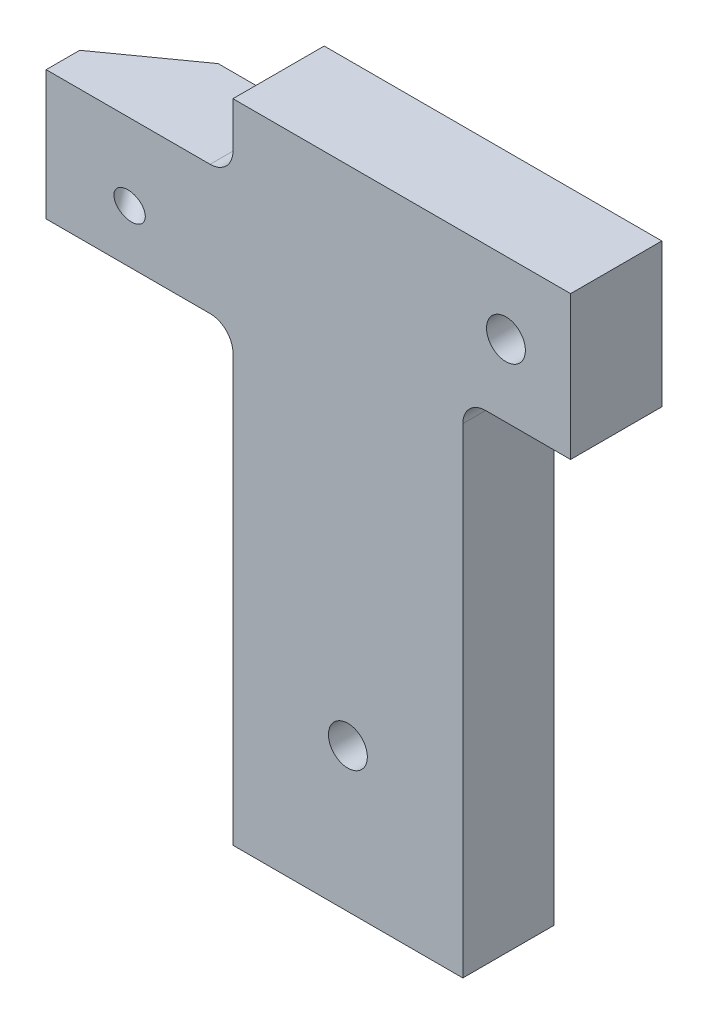
ISO-10303-21;
HEADER;
FILE_DESCRIPTION(('STEP AP214'),'2;1');
FILE_NAME('part.step','',(''),(''),'','','');
FILE_SCHEMA(('AUTOMOTIVE_DESIGN { 1 0 10303 214 1 1 1 1 }'));
ENDSEC;
DATA;
#1=APPLICATION_CONTEXT('core data for automotive mechanical design processes');
#2=APPLICATION_PROTOCOL_DEFINITION('international standard','automotive_design',2000,#1);
#3=PRODUCT_CONTEXT('',#1,'mechanical');
#4=PRODUCT('Part','Part','',(#3));
#5=PRODUCT_RELATED_PRODUCT_CATEGORY('part','',(#4));
#6=PRODUCT_DEFINITION_FORMATION('','',#4);
#7=PRODUCT_DEFINITION_CONTEXT('part definition',#1,'design');
#8=PRODUCT_DEFINITION('design','',#6,#7);
#9=PRODUCT_DEFINITION_SHAPE('','',#8);
#10=(LENGTH_UNIT() NAMED_UNIT(*) SI_UNIT(.MILLI.,.METRE.));
#11=(NAMED_UNIT(*) PLANE_ANGLE_UNIT() SI_UNIT($,.RADIAN.));
#12=(NAMED_UNIT(*) SI_UNIT($,.STERADIAN.) SOLID_ANGLE_UNIT());
#13=UNCERTAINTY_MEASURE_WITH_UNIT(LENGTH_MEASURE(1.E-05),#10,'distance_accuracy_value','');
#14=(GEOMETRIC_REPRESENTATION_CONTEXT(3) GLOBAL_UNCERTAINTY_ASSIGNED_CONTEXT((#13)) GLOBAL_UNIT_ASSIGNED_CONTEXT((#10,
#11,#12)) REPRESENTATION_CONTEXT('',''));
#15=CARTESIAN_POINT('',(0.,0.,0.));
#16=DIRECTION('',(0.,0.,1.));
#17=DIRECTION('',(1.,0.,0.));
#18=AXIS2_PLACEMENT_3D('',#15,#16,#17);
#19=CARTESIAN_POINT('',(0.,0.,6.35));
#20=DIRECTION('',(1.,0.,0.));
#21=DIRECTION('',(0.,0.,-1.));
#22=AXIS2_PLACEMENT_3D('',#19,#20,#21);
#23=PLANE('',#22);
#24=DIRECTION('',(0.,-1.,0.));
#25=VECTOR('',#24,1.);
#26=CARTESIAN_POINT('',(0.,0.,6.35));
#27=LINE('',#26,#25);
#28=CARTESIAN_POINT('',(0.,40.25,6.35));
#29=VERTEX_POINT('',#28);
#30=CARTESIAN_POINT('',(0.,31.25,6.35));
#31=VERTEX_POINT('',#30);
#32=EDGE_CURVE('E178',#29,#31,#27,.T.);
#33=ORIENTED_EDGE('',*,*,#32,.F.);
#34=DIRECTION('',(0.,0.,-1.));
#35=VECTOR('',#34,1.);
#36=CARTESIAN_POINT('',(0.,40.25,19.));
#37=LINE('',#36,#35);
#38=CARTESIAN_POINT('',(0.,40.25,4.01534281482165));
#39=VERTEX_POINT('',#38);
#40=EDGE_CURVE('E159',#29,#39,#37,.T.);
#41=ORIENTED_EDGE('',*,*,#40,.T.);
#42=DIRECTION('',(0.,0.979906593686997,0.199456931814229));
#43=VECTOR('',#42,1.);
#44=CARTESIAN_POINT('',(0.,2.05757526475973,-3.75860615675775));
#45=LINE('',#44,#43);
#46=CARTESIAN_POINT('',(0.,31.25,2.18342087665632));
#47=VERTEX_POINT('',#46);
#48=EDGE_CURVE('E165',#47,#39,#45,.T.);
#49=ORIENTED_EDGE('',*,*,#48,.F.);
#50=DIRECTION('',(0.,0.,-1.));
#51=VECTOR('',#50,1.);
#52=CARTESIAN_POINT('',(0.,31.25,19.));
#53=LINE('',#52,#51);
#54=EDGE_CURVE('E234',#31,#47,#53,.T.);
#55=ORIENTED_EDGE('',*,*,#54,.F.);
#56=EDGE_LOOP('',(#33,#41,#49,#55));
#57=FACE_BOUND('',#56,.T.);
#58=ADVANCED_FACE('F40',(#57),#23,.F.);
#59=CARTESIAN_POINT('',(0.,45.,6.35));
#60=DIRECTION('',(0.,-1.,0.));
#61=DIRECTION('',(0.,0.,-1.));
#62=AXIS2_PLACEMENT_3D('',#59,#60,#61);
#63=PLANE('',#62);
#64=DIRECTION('',(-1.,0.,0.));
#65=VECTOR('',#64,1.);
#66=CARTESIAN_POINT('',(0.,45.,0.));
#67=LINE('',#66,#65);
#68=CARTESIAN_POINT('',(36.5,45.,0.));
#69=VERTEX_POINT('',#68);
#70=CARTESIAN_POINT('',(12.9999999999999,45.,0.));
#71=VERTEX_POINT('',#70);
#72=EDGE_CURVE('E167',#69,#71,#67,.T.);
#73=ORIENTED_EDGE('',*,*,#72,.T.);
#74=DIRECTION('',(0.,0.,-1.));
#75=VECTOR('',#74,1.);
#76=CARTESIAN_POINT('',(12.9999999999999,45.,19.));
#77=LINE('',#76,#75);
#78=CARTESIAN_POINT('',(12.9999999999999,45.,6.35));
#79=VERTEX_POINT('',#78);
#80=EDGE_CURVE('E212',#79,#71,#77,.T.);
#81=ORIENTED_EDGE('',*,*,#80,.F.);
#82=DIRECTION('',(-1.,0.,0.));
#83=VECTOR('',#82,1.);
#84=CARTESIAN_POINT('',(0.,45.,6.35));
#85=LINE('',#84,#83);
#86=CARTESIAN_POINT('',(36.5,45.,6.35));
#87=VERTEX_POINT('',#86);
#88=EDGE_CURVE('E173',#87,#79,#85,.T.);
#89=ORIENTED_EDGE('',*,*,#88,.F.);
#90=DIRECTION('',(0.,0.,-1.));
#91=VECTOR('',#90,1.);
#92=CARTESIAN_POINT('',(36.5,45.,6.35));
#93=LINE('',#92,#91);
#94=EDGE_CURVE('E179',#87,#69,#93,.T.);
#95=ORIENTED_EDGE('',*,*,#94,.T.);
#96=EDGE_LOOP('',(#73,#81,#89,#95));
#97=FACE_BOUND('',#96,.T.);
#98=ADVANCED_FACE('F216',(#97),#63,.F.);
#99=CARTESIAN_POINT('',(0.,0.,0.));
#100=DIRECTION('',(0.,0.,-1.));
#101=DIRECTION('',(-1.,0.,0.));
#102=AXIS2_PLACEMENT_3D('',#99,#100,#101);
#103=PLANE('',#102);
#104=CARTESIAN_POINT('',(20.9999999999998,10.0000000000001,0.));
#105=DIRECTION('',(0.,0.,-1.));
#106=DIRECTION('',(-1.,0.,0.));
#107=AXIS2_PLACEMENT_3D('',#104,#105,#106);
#108=CIRCLE('',#107,2.38125);
#109=CARTESIAN_POINT('',(18.6187499999998,10.0000000000001,0.));
#110=VERTEX_POINT('',#109);
#111=EDGE_CURVE('E322',#110,#110,#108,.T.);
#112=ORIENTED_EDGE('',*,*,#111,.F.);
#113=EDGE_LOOP('',(#112));
#114=FACE_BOUND('',#113,.T.);
#115=CARTESIAN_POINT('',(31.9999999999997,40.0000000000001,0.));
#116=DIRECTION('',(0.,0.,-1.));
#117=DIRECTION('',(-1.,0.,0.));
#118=AXIS2_PLACEMENT_3D('',#115,#116,#117);
#119=CIRCLE('',#118,2.38125);
#120=CARTESIAN_POINT('',(29.6187499999997,40.0000000000001,0.));
#121=VERTEX_POINT('',#120);
#122=EDGE_CURVE('E310',#121,#121,#119,.T.);
#123=ORIENTED_EDGE('',*,*,#122,.F.);
#124=EDGE_LOOP('',(#123));
#125=FACE_BOUND('',#124,.T.);
#126=DIRECTION('',(-1.,0.,0.));
#127=VECTOR('',#126,1.);
#128=CARTESIAN_POINT('',(11.4124999999999,40.25,0.));
#129=LINE('',#128,#127);
#130=CARTESIAN_POINT('',(11.4124999999999,40.25,0.));
#131=VERTEX_POINT('',#130);
#132=CARTESIAN_POINT('',(5.62283855684455,40.25,0.));
#133=VERTEX_POINT('',#132);
#134=EDGE_CURVE('E62',#131,#133,#129,.T.);
#135=ORIENTED_EDGE('',*,*,#134,.F.);
#136=CARTESIAN_POINT('',(11.4124999999999,41.8375,0.));
#137=DIRECTION('',(0.,0.,-1.));
#138=DIRECTION('',(-1.,0.,0.));
#139=AXIS2_PLACEMENT_3D('',#136,#137,#138);
#140=CIRCLE('',#139,1.5875);
#141=CARTESIAN_POINT('',(12.9999999999999,41.8375,0.));
#142=VERTEX_POINT('',#141);
#143=EDGE_CURVE('E221',#142,#131,#140,.T.);
#144=ORIENTED_EDGE('',*,*,#143,.F.);
#145=DIRECTION('',(0.,-1.,0.));
#146=VECTOR('',#145,1.);
#147=CARTESIAN_POINT('',(12.9999999999999,45.,0.));
#148=LINE('',#147,#146);
#149=EDGE_CURVE('E256',#71,#142,#148,.T.);
#150=ORIENTED_EDGE('',*,*,#149,.F.);
#151=ORIENTED_EDGE('',*,*,#72,.F.);
#152=DIRECTION('',(0.,1.,0.));
#153=VECTOR('',#152,1.);
#154=CARTESIAN_POINT('',(36.5,0.,0.));
#155=LINE('',#154,#153);
#156=CARTESIAN_POINT('',(36.5,35.,0.));
#157=VERTEX_POINT('',#156);
#158=EDGE_CURVE('E164',#157,#69,#155,.T.);
#159=ORIENTED_EDGE('',*,*,#158,.F.);
#160=DIRECTION('',(1.,0.,0.));
#161=VECTOR('',#160,1.);
#162=CARTESIAN_POINT('',(36.5,35.,0.));
#163=LINE('',#162,#161);
#164=CARTESIAN_POINT('',(30.5874999999999,35.,0.));
#165=VERTEX_POINT('',#164);
#166=EDGE_CURVE('E149',#165,#157,#163,.T.);
#167=ORIENTED_EDGE('',*,*,#166,.F.);
#168=CARTESIAN_POINT('',(30.5874999999999,33.4125,0.));
#169=DIRECTION('',(0.,0.,-1.));
#170=DIRECTION('',(1.,0.,0.));
#171=AXIS2_PLACEMENT_3D('',#168,#169,#170);
#172=CIRCLE('',#171,1.5875);
#173=CARTESIAN_POINT('',(29.,33.4125,0.));
#174=VERTEX_POINT('',#173);
#175=EDGE_CURVE('E158',#174,#165,#172,.T.);
#176=ORIENTED_EDGE('',*,*,#175,.F.);
#177=DIRECTION('',(0.,1.,0.));
#178=VECTOR('',#177,1.);
#179=CARTESIAN_POINT('',(29.,0.,0.));
#180=LINE('',#179,#178);
#181=CARTESIAN_POINT('',(29.,0.,0.));
#182=VERTEX_POINT('',#181);
#183=EDGE_CURVE('E141',#182,#174,#180,.T.);
#184=ORIENTED_EDGE('',*,*,#183,.F.);
#185=DIRECTION('',(1.,0.,0.));
#186=VECTOR('',#185,1.);
#187=CARTESIAN_POINT('',(0.,0.,0.));
#188=LINE('',#187,#186);
#189=CARTESIAN_POINT('',(13.,0.,0.));
#190=VERTEX_POINT('',#189);
#191=EDGE_CURVE('E155',#190,#182,#188,.T.);
#192=ORIENTED_EDGE('',*,*,#191,.F.);
#193=DIRECTION('',(0.,-1.,0.));
#194=VECTOR('',#193,1.);
#195=CARTESIAN_POINT('',(13.,0.,0.));
#196=LINE('',#195,#194);
#197=CARTESIAN_POINT('',(13.,29.6625,0.));
#198=VERTEX_POINT('',#197);
#199=EDGE_CURVE('E232',#198,#190,#196,.T.);
#200=ORIENTED_EDGE('',*,*,#199,.F.);
#201=CARTESIAN_POINT('',(11.4124999999999,29.6625,0.));
#202=DIRECTION('',(0.,0.,-1.));
#203=DIRECTION('',(-1.,0.,0.));
#204=AXIS2_PLACEMENT_3D('',#201,#202,#203);
#205=CIRCLE('',#204,1.58749999999999);
#206=CARTESIAN_POINT('',(11.4124999999999,31.25,0.));
#207=VERTEX_POINT('',#206);
#208=EDGE_CURVE('E228',#207,#198,#205,.T.);
#209=ORIENTED_EDGE('',*,*,#208,.F.);
#210=DIRECTION('',(1.,0.,0.));
#211=VECTOR('',#210,1.);
#212=CARTESIAN_POINT('',(0.,31.25,0.));
#213=LINE('',#212,#211);
#214=CARTESIAN_POINT('',(3.05752800128669,31.25,0.));
#215=VERTEX_POINT('',#214);
#216=EDGE_CURVE('E225',#215,#207,#213,.T.);
#217=ORIENTED_EDGE('',*,*,#216,.F.);
#218=DIRECTION('',(0.274116671041716,0.961696444132455,0.));
#219=VECTOR('',#218,1.);
#220=CARTESIAN_POINT('',(-5.4102466171649,1.54210697279826,0.));
#221=LINE('',#220,#219);
#222=EDGE_CURVE('E182',#215,#133,#221,.T.);
#223=ORIENTED_EDGE('',*,*,#222,.T.);
#224=EDGE_LOOP('',(#135,#144,#150,#151,#159,#167,#176,#184,#192,#200,#209,#217,#223));
#225=FACE_BOUND('',#224,.T.);
#226=ADVANCED_FACE('F153',(#114,#125,#225),#103,.T.);
#227=CARTESIAN_POINT('',(0.,0.,6.35));
#228=DIRECTION('',(0.,1.,0.));
#229=DIRECTION('',(0.,0.,1.));
#230=AXIS2_PLACEMENT_3D('',#227,#228,#229);
#231=PLANE('',#230);
#232=ORIENTED_EDGE('',*,*,#191,.T.);
#233=DIRECTION('',(0.,0.,-1.));
#234=VECTOR('',#233,1.);
#235=CARTESIAN_POINT('',(29.,0.,19.));
#236=LINE('',#235,#234);
#237=CARTESIAN_POINT('',(29.,0.,6.35));
#238=VERTEX_POINT('',#237);
#239=EDGE_CURVE('E138',#238,#182,#236,.T.);
#240=ORIENTED_EDGE('',*,*,#239,.F.);
#241=DIRECTION('',(1.,0.,0.));
#242=VECTOR('',#241,1.);
#243=CARTESIAN_POINT('',(0.,0.,6.35));
#244=LINE('',#243,#242);
#245=CARTESIAN_POINT('',(13.,0.,6.35));
#246=VERTEX_POINT('',#245);
#247=EDGE_CURVE('E247',#246,#238,#244,.T.);
#248=ORIENTED_EDGE('',*,*,#247,.F.);
#249=DIRECTION('',(0.,0.,-1.));
#250=VECTOR('',#249,1.);
#251=CARTESIAN_POINT('',(13.,0.,19.));
#252=LINE('',#251,#250);
#253=EDGE_CURVE('E163',#246,#190,#252,.T.);
#254=ORIENTED_EDGE('',*,*,#253,.T.);
#255=EDGE_LOOP('',(#232,#240,#248,#254));
#256=FACE_BOUND('',#255,.T.);
#257=ADVANCED_FACE('F162',(#256),#231,.F.);
#258=CARTESIAN_POINT('',(36.5,0.,6.35));
#259=DIRECTION('',(-1.,0.,0.));
#260=DIRECTION('',(0.,0.,1.));
#261=AXIS2_PLACEMENT_3D('',#258,#259,#260);
#262=PLANE('',#261);
#263=DIRECTION('',(0.,1.,0.));
#264=VECTOR('',#263,1.);
#265=CARTESIAN_POINT('',(36.5,0.,6.35));
#266=LINE('',#265,#264);
#267=CARTESIAN_POINT('',(36.5,35.,6.35));
#268=VERTEX_POINT('',#267);
#269=EDGE_CURVE('E248',#268,#87,#266,.T.);
#270=ORIENTED_EDGE('',*,*,#269,.F.);
#271=DIRECTION('',(0.,0.,-1.));
#272=VECTOR('',#271,1.);
#273=CARTESIAN_POINT('',(36.5,35.,19.));
#274=LINE('',#273,#272);
#275=EDGE_CURVE('E229',#268,#157,#274,.T.);
#276=ORIENTED_EDGE('',*,*,#275,.T.);
#277=ORIENTED_EDGE('',*,*,#158,.T.);
#278=ORIENTED_EDGE('',*,*,#94,.F.);
#279=EDGE_LOOP('',(#270,#276,#277,#278));
#280=FACE_BOUND('',#279,.T.);
#281=ADVANCED_FACE('F253',(#280),#262,.F.);
#282=CARTESIAN_POINT('',(0.,0.,6.35));
#283=DIRECTION('',(0.,0.,-1.));
#284=DIRECTION('',(-1.,0.,0.));
#285=AXIS2_PLACEMENT_3D('',#282,#283,#284);
#286=PLANE('',#285);
#287=CARTESIAN_POINT('',(20.9999999999998,10.0000000000001,6.35));
#288=DIRECTION('',(0.,0.,-1.));
#289=DIRECTION('',(-1.,0.,0.));
#290=AXIS2_PLACEMENT_3D('',#287,#288,#289);
#291=CIRCLE('',#290,1.35255);
#292=CARTESIAN_POINT('',(19.6474499999998,10.0000000000001,6.35));
#293=VERTEX_POINT('',#292);
#294=EDGE_CURVE('E313',#293,#293,#291,.T.);
#295=ORIENTED_EDGE('',*,*,#294,.T.);
#296=EDGE_LOOP('',(#295));
#297=FACE_BOUND('',#296,.T.);
#298=CARTESIAN_POINT('',(31.9999999999997,40.0000000000001,6.35));
#299=DIRECTION('',(0.,0.,-1.));
#300=DIRECTION('',(-1.,0.,0.));
#301=AXIS2_PLACEMENT_3D('',#298,#299,#300);
#302=CIRCLE('',#301,1.35255);
#303=CARTESIAN_POINT('',(30.6474499999997,40.0000000000001,6.35));
#304=VERTEX_POINT('',#303);
#305=EDGE_CURVE('E301',#304,#304,#302,.T.);
#306=ORIENTED_EDGE('',*,*,#305,.T.);
#307=EDGE_LOOP('',(#306));
#308=FACE_BOUND('',#307,.T.);
#309=CARTESIAN_POINT('',(5.80778863419592,34.9460822620643,6.35));
#310=DIRECTION('',(0.,0.,-1.));
#311=DIRECTION('',(-0.961696444132455,0.274116671041716,0.));
#312=AXIS2_PLACEMENT_3D('',#309,#310,#311);
#313=ELLIPSE('',#312,1.10729183960487,0.88899999999999);
#314=CARTESIAN_POINT('',(4.74291000943104,35.2496094150085,6.35));
#315=VERTEX_POINT('',#314);
#316=EDGE_CURVE('E258',#315,#315,#313,.T.);
#317=ORIENTED_EDGE('',*,*,#316,.T.);
#318=EDGE_LOOP('',(#317));
#319=FACE_BOUND('',#318,.T.);
#320=CARTESIAN_POINT('',(11.4124999999999,41.8375,6.35));
#321=DIRECTION('',(0.,0.,-1.));
#322=DIRECTION('',(-1.,0.,0.));
#323=AXIS2_PLACEMENT_3D('',#320,#321,#322);
#324=CIRCLE('',#323,1.5875);
#325=CARTESIAN_POINT('',(12.9999999999999,41.8375,6.35));
#326=VERTEX_POINT('',#325);
#327=CARTESIAN_POINT('',(11.4124999999999,40.25,6.35));
#328=VERTEX_POINT('',#327);
#329=EDGE_CURVE('E11',#326,#328,#324,.T.);
#330=ORIENTED_EDGE('',*,*,#329,.T.);
#331=DIRECTION('',(-1.,0.,0.));
#332=VECTOR('',#331,1.);
#333=CARTESIAN_POINT('',(0.,40.25,6.35));
#334=LINE('',#333,#332);
#335=EDGE_CURVE('E170',#328,#29,#334,.T.);
#336=ORIENTED_EDGE('',*,*,#335,.T.);
#337=ORIENTED_EDGE('',*,*,#32,.T.);
#338=DIRECTION('',(1.,0.,0.));
#339=VECTOR('',#338,1.);
#340=CARTESIAN_POINT('',(0.,31.25,6.35));
#341=LINE('',#340,#339);
#342=CARTESIAN_POINT('',(11.4124999999999,31.25,6.35));
#343=VERTEX_POINT('',#342);
#344=EDGE_CURVE('E236',#31,#343,#341,.T.);
#345=ORIENTED_EDGE('',*,*,#344,.T.);
#346=CARTESIAN_POINT('',(11.4124999999999,29.6625,6.35));
#347=DIRECTION('',(0.,0.,-1.));
#348=DIRECTION('',(-1.,0.,0.));
#349=AXIS2_PLACEMENT_3D('',#346,#347,#348);
#350=CIRCLE('',#349,1.58749999999999);
#351=CARTESIAN_POINT('',(13.,29.6625,6.35));
#352=VERTEX_POINT('',#351);
#353=EDGE_CURVE('E189',#343,#352,#350,.T.);
#354=ORIENTED_EDGE('',*,*,#353,.T.);
#355=DIRECTION('',(0.,-1.,0.));
#356=VECTOR('',#355,1.);
#357=CARTESIAN_POINT('',(13.,0.,6.35));
#358=LINE('',#357,#356);
#359=EDGE_CURVE('E192',#352,#246,#358,.T.);
#360=ORIENTED_EDGE('',*,*,#359,.T.);
#361=ORIENTED_EDGE('',*,*,#247,.T.);
#362=DIRECTION('',(0.,1.,0.));
#363=VECTOR('',#362,1.);
#364=CARTESIAN_POINT('',(29.,0.,6.35));
#365=LINE('',#364,#363);
#366=CARTESIAN_POINT('',(29.,33.4125,6.35));
#367=VERTEX_POINT('',#366);
#368=EDGE_CURVE('E144',#238,#367,#365,.T.);
#369=ORIENTED_EDGE('',*,*,#368,.T.);
#370=CARTESIAN_POINT('',(30.5874999999999,33.4125,6.35));
#371=DIRECTION('',(0.,0.,-1.));
#372=DIRECTION('',(-1.,0.,0.));
#373=AXIS2_PLACEMENT_3D('',#370,#371,#372);
#374=CIRCLE('',#373,1.5875);
#375=CARTESIAN_POINT('',(30.5874999999999,35.,6.35));
#376=VERTEX_POINT('',#375);
#377=EDGE_CURVE('E196',#367,#376,#374,.T.);
#378=ORIENTED_EDGE('',*,*,#377,.T.);
#379=DIRECTION('',(1.,0.,0.));
#380=VECTOR('',#379,1.);
#381=CARTESIAN_POINT('',(0.,35.,6.35));
#382=LINE('',#381,#380);
#383=EDGE_CURVE('E199',#376,#268,#382,.T.);
#384=ORIENTED_EDGE('',*,*,#383,.T.);
#385=ORIENTED_EDGE('',*,*,#269,.T.);
#386=ORIENTED_EDGE('',*,*,#88,.T.);
#387=DIRECTION('',(0.,-1.,0.));
#388=VECTOR('',#387,1.);
#389=CARTESIAN_POINT('',(12.9999999999999,0.,6.35));
#390=LINE('',#389,#388);
#391=EDGE_CURVE('E47',#79,#326,#390,.T.);
#392=ORIENTED_EDGE('',*,*,#391,.T.);
#393=EDGE_LOOP('',(#330,#336,#337,#345,#354,#360,#361,#369,#378,#384,#385,#386,#392));
#394=FACE_BOUND('',#393,.T.);
#395=ADVANCED_FACE('F204',(#297,#308,#319,#394),#286,.F.);
#396=CARTESIAN_POINT('',(-1.92288980037105,0.548089944674044,-2.6926963421851));
#397=DIRECTION('',(-0.573332653303148,0.163419589707173,-0.802859705276278));
#398=DIRECTION('',(-0.813799896321473,0.,0.581145187321687));
#399=AXIS2_PLACEMENT_3D('',#396,#397,#398);
#400=PLANE('',#399);
#401=CARTESIAN_POINT('',(2.32710839424392,35.9381962354055,1.47586995436444));
#402=DIRECTION('',(-0.573332653303148,0.163419589707173,-0.802859705276278));
#403=DIRECTION('',(-0.813799896321474,0.,0.581145187321687));
#404=AXIS2_PLACEMENT_3D('',#401,#402,#403);
#405=CIRCLE('',#404,0.888999999999989);
#406=CARTESIAN_POINT('',(1.60364028641414,35.9381962354055,1.99250802589341));
#407=VERTEX_POINT('',#406);
#408=EDGE_CURVE('E262',#407,#407,#405,.T.);
#409=ORIENTED_EDGE('',*,*,#408,.F.);
#410=EDGE_LOOP('',(#409));
#411=FACE_BOUND('',#410,.T.);
#412=DIRECTION('',(-0.813799896321473,0.,0.581145187321688));
#413=VECTOR('',#412,1.);
#414=CARTESIAN_POINT('',(1.89899974059219,40.25,2.65924217514507));
#415=LINE('',#414,#413);
#416=EDGE_CURVE('E187',#133,#39,#415,.T.);
#417=ORIENTED_EDGE('',*,*,#416,.F.);
#418=ORIENTED_EDGE('',*,*,#222,.F.);
#419=DIRECTION('',(0.813799896321473,0.,-0.581145187321688));
#420=VECTOR('',#419,1.);
#421=CARTESIAN_POINT('',(1.03261810251141,31.25,1.44601473624229));
#422=LINE('',#421,#420);
#423=EDGE_CURVE('E185',#47,#215,#422,.T.);
#424=ORIENTED_EDGE('',*,*,#423,.F.);
#425=ORIENTED_EDGE('',*,*,#48,.T.);
#426=EDGE_LOOP('',(#417,#418,#424,#425));
#427=FACE_BOUND('',#426,.T.);
#428=ADVANCED_FACE('F276',(#411,#427),#400,.T.);
#429=CARTESIAN_POINT('',(13.,0.,19.));
#430=DIRECTION('',(1.,0.,0.));
#431=DIRECTION('',(0.,0.,-1.));
#432=AXIS2_PLACEMENT_3D('',#429,#430,#431);
#433=PLANE('',#432);
#434=DIRECTION('',(0.,0.,-1.));
#435=VECTOR('',#434,1.);
#436=CARTESIAN_POINT('',(13.,29.6625,19.));
#437=LINE('',#436,#435);
#438=EDGE_CURVE('E237',#352,#198,#437,.T.);
#439=ORIENTED_EDGE('',*,*,#438,.T.);
#440=ORIENTED_EDGE('',*,*,#199,.T.);
#441=ORIENTED_EDGE('',*,*,#253,.F.);
#442=ORIENTED_EDGE('',*,*,#359,.F.);
#443=EDGE_LOOP('',(#439,#440,#441,#442));
#444=FACE_BOUND('',#443,.T.);
#445=ADVANCED_FACE('F288',(#444),#433,.F.);
#446=CARTESIAN_POINT('',(11.4124999999999,29.6625,19.));
#447=DIRECTION('',(0.,0.,-1.));
#448=DIRECTION('',(-1.,0.,0.));
#449=AXIS2_PLACEMENT_3D('',#446,#447,#448);
#450=CYLINDRICAL_SURFACE('',#449,1.58749999999999);
#451=DIRECTION('',(0.,0.,-1.));
#452=VECTOR('',#451,1.);
#453=CARTESIAN_POINT('',(11.4124999999999,31.25,19.));
#454=LINE('',#453,#452);
#455=EDGE_CURVE('E239',#343,#207,#454,.T.);
#456=ORIENTED_EDGE('',*,*,#455,.T.);
#457=ORIENTED_EDGE('',*,*,#208,.T.);
#458=ORIENTED_EDGE('',*,*,#438,.F.);
#459=ORIENTED_EDGE('',*,*,#353,.F.);
#460=EDGE_LOOP('',(#456,#457,#458,#459));
#461=FACE_BOUND('',#460,.T.);
#462=ADVANCED_FACE('F285',(#461),#450,.F.);
#463=CARTESIAN_POINT('',(0.,31.25,19.));
#464=DIRECTION('',(0.,1.,0.));
#465=DIRECTION('',(-1.,0.,0.));
#466=AXIS2_PLACEMENT_3D('',#463,#464,#465);
#467=PLANE('',#466);
#468=ORIENTED_EDGE('',*,*,#54,.T.);
#469=ORIENTED_EDGE('',*,*,#423,.T.);
#470=ORIENTED_EDGE('',*,*,#216,.T.);
#471=ORIENTED_EDGE('',*,*,#455,.F.);
#472=ORIENTED_EDGE('',*,*,#344,.F.);
#473=EDGE_LOOP('',(#468,#469,#470,#471,#472));
#474=FACE_BOUND('',#473,.T.);
#475=ADVANCED_FACE('F283',(#474),#467,.F.);
#476=CARTESIAN_POINT('',(11.4124999999999,41.8375,19.));
#477=DIRECTION('',(0.,0.,-1.));
#478=DIRECTION('',(-1.,0.,0.));
#479=AXIS2_PLACEMENT_3D('',#476,#477,#478);
#480=CYLINDRICAL_SURFACE('',#479,1.5875);
#481=DIRECTION('',(0.,0.,-1.));
#482=VECTOR('',#481,1.);
#483=CARTESIAN_POINT('',(12.9999999999999,41.8375,19.));
#484=LINE('',#483,#482);
#485=EDGE_CURVE('E214',#326,#142,#484,.T.);
#486=ORIENTED_EDGE('',*,*,#485,.T.);
#487=ORIENTED_EDGE('',*,*,#143,.T.);
#488=DIRECTION('',(0.,0.,-1.));
#489=VECTOR('',#488,1.);
#490=CARTESIAN_POINT('',(11.4124999999999,40.25,19.));
#491=LINE('',#490,#489);
#492=EDGE_CURVE('E219',#328,#131,#491,.T.);
#493=ORIENTED_EDGE('',*,*,#492,.F.);
#494=ORIENTED_EDGE('',*,*,#329,.F.);
#495=EDGE_LOOP('',(#486,#487,#493,#494));
#496=FACE_BOUND('',#495,.T.);
#497=ADVANCED_FACE('F270',(#496),#480,.F.);
#498=CARTESIAN_POINT('',(12.9999999999999,45.,19.));
#499=DIRECTION('',(1.,0.,0.));
#500=DIRECTION('',(0.,0.,-1.));
#501=AXIS2_PLACEMENT_3D('',#498,#499,#500);
#502=PLANE('',#501);
#503=ORIENTED_EDGE('',*,*,#80,.T.);
#504=ORIENTED_EDGE('',*,*,#149,.T.);
#505=ORIENTED_EDGE('',*,*,#485,.F.);
#506=ORIENTED_EDGE('',*,*,#391,.F.);
#507=EDGE_LOOP('',(#503,#504,#505,#506));
#508=FACE_BOUND('',#507,.T.);
#509=ADVANCED_FACE('F210',(#508),#502,.F.);
#510=CARTESIAN_POINT('',(11.4124999999999,40.25,19.));
#511=DIRECTION('',(0.,-1.,0.));
#512=DIRECTION('',(1.,0.,0.));
#513=AXIS2_PLACEMENT_3D('',#510,#511,#512);
#514=PLANE('',#513);
#515=ORIENTED_EDGE('',*,*,#492,.T.);
#516=ORIENTED_EDGE('',*,*,#134,.T.);
#517=ORIENTED_EDGE('',*,*,#416,.T.);
#518=ORIENTED_EDGE('',*,*,#40,.F.);
#519=ORIENTED_EDGE('',*,*,#335,.F.);
#520=EDGE_LOOP('',(#515,#516,#517,#518,#519));
#521=FACE_BOUND('',#520,.T.);
#522=ADVANCED_FACE('F268',(#521),#514,.F.);
#523=CARTESIAN_POINT('',(36.5,35.,19.));
#524=DIRECTION('',(0.,1.,0.));
#525=DIRECTION('',(0.,0.,1.));
#526=AXIS2_PLACEMENT_3D('',#523,#524,#525);
#527=PLANE('',#526);
#528=DIRECTION('',(0.,0.,-1.));
#529=VECTOR('',#528,1.);
#530=CARTESIAN_POINT('',(30.5874999999999,35.,19.));
#531=LINE('',#530,#529);
#532=EDGE_CURVE('E292',#376,#165,#531,.T.);
#533=ORIENTED_EDGE('',*,*,#532,.T.);
#534=ORIENTED_EDGE('',*,*,#166,.T.);
#535=ORIENTED_EDGE('',*,*,#275,.F.);
#536=ORIENTED_EDGE('',*,*,#383,.F.);
#537=EDGE_LOOP('',(#533,#534,#535,#536));
#538=FACE_BOUND('',#537,.T.);
#539=ADVANCED_FACE('F421',(#538),#527,.F.);
#540=CARTESIAN_POINT('',(30.5874999999999,33.4125,19.));
#541=DIRECTION('',(0.,0.,-1.));
#542=DIRECTION('',(-1.,0.,0.));
#543=AXIS2_PLACEMENT_3D('',#540,#541,#542);
#544=CYLINDRICAL_SURFACE('',#543,1.5875);
#545=DIRECTION('',(0.,0.,-1.));
#546=VECTOR('',#545,1.);
#547=CARTESIAN_POINT('',(29.,33.4125,19.));
#548=LINE('',#547,#546);
#549=EDGE_CURVE('E54',#367,#174,#548,.T.);
#550=ORIENTED_EDGE('',*,*,#549,.T.);
#551=ORIENTED_EDGE('',*,*,#175,.T.);
#552=ORIENTED_EDGE('',*,*,#532,.F.);
#553=ORIENTED_EDGE('',*,*,#377,.F.);
#554=EDGE_LOOP('',(#550,#551,#552,#553));
#555=FACE_BOUND('',#554,.T.);
#556=ADVANCED_FACE('F291',(#555),#544,.F.);
#557=CARTESIAN_POINT('',(29.,0.,19.));
#558=DIRECTION('',(-1.,0.,0.));
#559=DIRECTION('',(0.,0.,1.));
#560=AXIS2_PLACEMENT_3D('',#557,#558,#559);
#561=PLANE('',#560);
#562=ORIENTED_EDGE('',*,*,#239,.T.);
#563=ORIENTED_EDGE('',*,*,#183,.T.);
#564=ORIENTED_EDGE('',*,*,#549,.F.);
#565=ORIENTED_EDGE('',*,*,#368,.F.);
#566=EDGE_LOOP('',(#562,#563,#564,#565));
#567=FACE_BOUND('',#566,.T.);
#568=ADVANCED_FACE('F140',(#567),#561,.F.);
#569=CARTESIAN_POINT('',(2.32710839424392,35.9381962354055,1.47586995436444));
#570=DIRECTION('',(-0.573332653303148,0.163419589707173,-0.802859705276278));
#571=DIRECTION('',(-0.813799896321474,0.,0.581145187321687));
#572=AXIS2_PLACEMENT_3D('',#569,#570,#571);
#573=CYLINDRICAL_SURFACE('',#572,0.88899999999999);
#574=ORIENTED_EDGE('',*,*,#408,.T.);
#575=EDGE_LOOP('',(#574));
#576=FACE_BOUND('',#575,.T.);
#577=ORIENTED_EDGE('',*,*,#316,.F.);
#578=EDGE_LOOP('',(#577));
#579=FACE_BOUND('',#578,.T.);
#580=ADVANCED_FACE('F440',(#576,#579),#573,.F.);
#581=CARTESIAN_POINT('',(31.9999999999997,40.0000000000001,0.));
#582=DIRECTION('',(0.,0.,-1.));
#583=DIRECTION('',(-1.,0.,0.));
#584=AXIS2_PLACEMENT_3D('',#581,#582,#583);
#585=CYLINDRICAL_SURFACE('',#584,1.35255);
#586=ORIENTED_EDGE('',*,*,#305,.F.);
#587=EDGE_LOOP('',(#586));
#588=FACE_BOUND('',#587,.T.);
#589=CARTESIAN_POINT('',(31.9999999999997,40.0000000000001,2.18439746));
#590=DIRECTION('',(0.,0.,-1.));
#591=DIRECTION('',(-1.,0.,0.));
#592=AXIS2_PLACEMENT_3D('',#589,#590,#591);
#593=CIRCLE('',#592,1.35255);
#594=CARTESIAN_POINT('',(30.6474499999997,40.0000000000001,2.18439746));
#595=VERTEX_POINT('',#594);
#596=EDGE_CURVE('E304',#595,#595,#593,.T.);
#597=ORIENTED_EDGE('',*,*,#596,.T.);
#598=EDGE_LOOP('',(#597));
#599=FACE_BOUND('',#598,.T.);
#600=ADVANCED_FACE('F346',(#588,#599),#585,.F.);
#601=CARTESIAN_POINT('',(33.3525499999997,40.0000000000001,2.18439746));
#602=DIRECTION('',(0.,0.,1.));
#603=DIRECTION('',(1.,0.,0.));
#604=AXIS2_PLACEMENT_3D('',#601,#602,#603);
#605=PLANE('',#604);
#606=ORIENTED_EDGE('',*,*,#596,.F.);
#607=EDGE_LOOP('',(#606));
#608=FACE_BOUND('',#607,.T.);
#609=CARTESIAN_POINT('',(31.9999999999997,40.0000000000001,2.18439746));
#610=DIRECTION('',(0.,0.,-1.));
#611=DIRECTION('',(-1.,0.,0.));
#612=AXIS2_PLACEMENT_3D('',#609,#610,#611);
#613=CIRCLE('',#612,2.38125);
#614=CARTESIAN_POINT('',(29.6187499999997,40.0000000000001,2.18439746));
#615=VERTEX_POINT('',#614);
#616=EDGE_CURVE('E307',#615,#615,#613,.T.);
#617=ORIENTED_EDGE('',*,*,#616,.T.);
#618=EDGE_LOOP('',(#617));
#619=FACE_BOUND('',#618,.T.);
#620=ADVANCED_FACE('F336',(#608,#619),#605,.F.);
#621=CARTESIAN_POINT('',(31.9999999999997,40.0000000000001,0.));
#622=DIRECTION('',(0.,0.,-1.));
#623=DIRECTION('',(-1.,0.,0.));
#624=AXIS2_PLACEMENT_3D('',#621,#622,#623);
#625=CYLINDRICAL_SURFACE('',#624,2.38125);
#626=ORIENTED_EDGE('',*,*,#616,.F.);
#627=EDGE_LOOP('',(#626));
#628=FACE_BOUND('',#627,.T.);
#629=ORIENTED_EDGE('',*,*,#122,.T.);
#630=EDGE_LOOP('',(#629));
#631=FACE_BOUND('',#630,.T.);
#632=ADVANCED_FACE('F333',(#628,#631),#625,.F.);
#633=CARTESIAN_POINT('',(20.9999999999998,10.0000000000001,0.));
#634=DIRECTION('',(0.,0.,-1.));
#635=DIRECTION('',(-1.,0.,0.));
#636=AXIS2_PLACEMENT_3D('',#633,#634,#635);
#637=CYLINDRICAL_SURFACE('',#636,1.35255);
#638=ORIENTED_EDGE('',*,*,#294,.F.);
#639=EDGE_LOOP('',(#638));
#640=FACE_BOUND('',#639,.T.);
#641=CARTESIAN_POINT('',(20.9999999999998,10.0000000000001,2.18439746));
#642=DIRECTION('',(0.,0.,-1.));
#643=DIRECTION('',(-1.,0.,0.));
#644=AXIS2_PLACEMENT_3D('',#641,#642,#643);
#645=CIRCLE('',#644,1.35255);
#646=CARTESIAN_POINT('',(19.6474499999998,10.0000000000001,2.18439746));
#647=VERTEX_POINT('',#646);
#648=EDGE_CURVE('E316',#647,#647,#645,.T.);
#649=ORIENTED_EDGE('',*,*,#648,.T.);
#650=EDGE_LOOP('',(#649));
#651=FACE_BOUND('',#650,.T.);
#652=ADVANCED_FACE('F335',(#640,#651),#637,.F.);
#653=CARTESIAN_POINT('',(22.3525499999998,10.0000000000001,2.18439746));
#654=DIRECTION('',(0.,0.,1.));
#655=DIRECTION('',(1.,0.,0.));
#656=AXIS2_PLACEMENT_3D('',#653,#654,#655);
#657=PLANE('',#656);
#658=ORIENTED_EDGE('',*,*,#648,.F.);
#659=EDGE_LOOP('',(#658));
#660=FACE_BOUND('',#659,.T.);
#661=CARTESIAN_POINT('',(20.9999999999998,10.0000000000001,2.18439746));
#662=DIRECTION('',(0.,0.,-1.));
#663=DIRECTION('',(-1.,0.,0.));
#664=AXIS2_PLACEMENT_3D('',#661,#662,#663);
#665=CIRCLE('',#664,2.38125);
#666=CARTESIAN_POINT('',(18.6187499999998,10.0000000000001,2.18439746));
#667=VERTEX_POINT('',#666);
#668=EDGE_CURVE('E319',#667,#667,#665,.T.);
#669=ORIENTED_EDGE('',*,*,#668,.T.);
#670=EDGE_LOOP('',(#669));
#671=FACE_BOUND('',#670,.T.);
#672=ADVANCED_FACE('F343',(#660,#671),#657,.F.);
#673=CARTESIAN_POINT('',(20.9999999999998,10.0000000000001,0.));
#674=DIRECTION('',(0.,0.,-1.));
#675=DIRECTION('',(-1.,0.,0.));
#676=AXIS2_PLACEMENT_3D('',#673,#674,#675);
#677=CYLINDRICAL_SURFACE('',#676,2.38125);
#678=ORIENTED_EDGE('',*,*,#668,.F.);
#679=EDGE_LOOP('',(#678));
#680=FACE_BOUND('',#679,.T.);
#681=ORIENTED_EDGE('',*,*,#111,.T.);
#682=EDGE_LOOP('',(#681));
#683=FACE_BOUND('',#682,.T.);
#684=ADVANCED_FACE('F326',(#680,#683),#677,.F.);
#685=CLOSED_SHELL('',(#58,#98,#226,#257,#281,#395,#428,#445,#462,#475,#497,#509,#522,#539,#556,
#568,#580,#600,#620,#632,#652,#672,#684));
#686=MANIFOLD_SOLID_BREP('B2',#685);
#687=ADVANCED_BREP_SHAPE_REPRESENTATION('',(#18,#686),#14);
#688=SHAPE_DEFINITION_REPRESENTATION(#9,#687);
ENDSEC;
END-ISO-10303-21;
